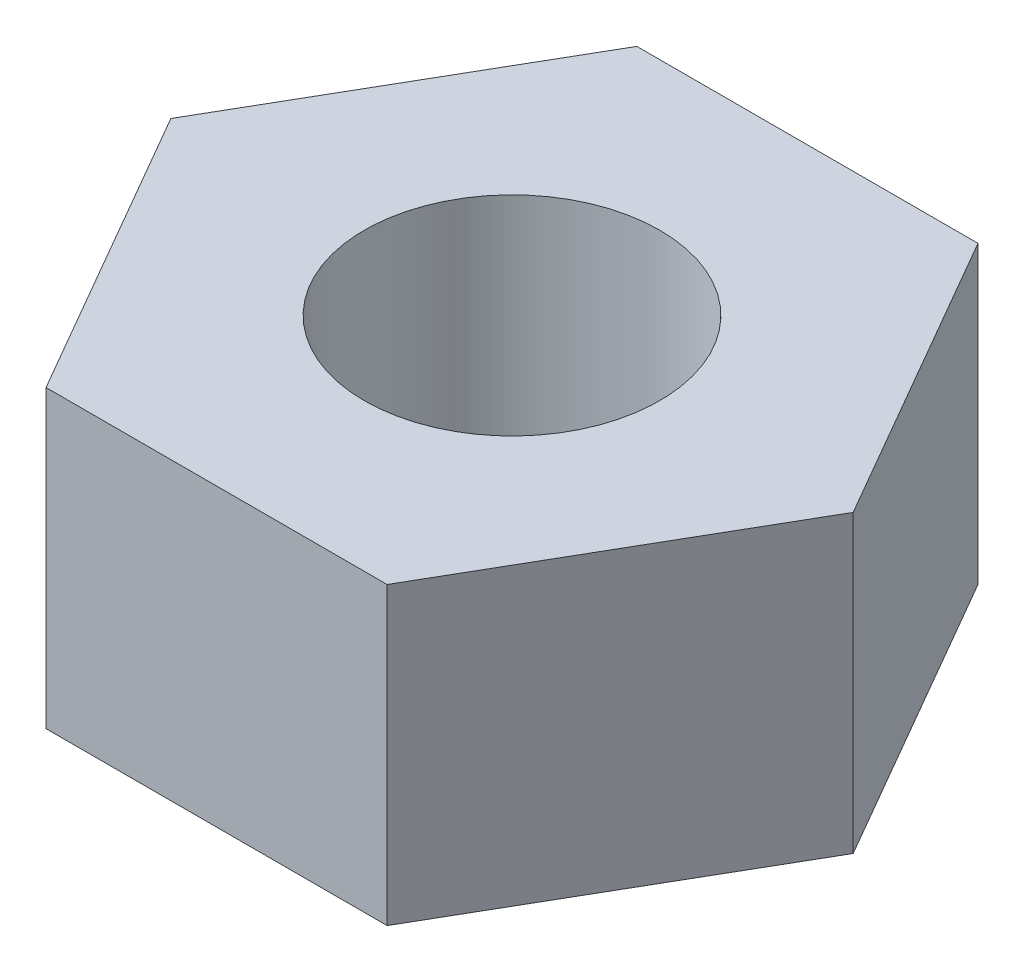
ISO-10303-21;
HEADER;
FILE_DESCRIPTION(('STEP AP214'),'2;1');
FILE_NAME('part.step','',(''),(''),'','','');
FILE_SCHEMA(('AUTOMOTIVE_DESIGN { 1 0 10303 214 1 1 1 1 }'));
ENDSEC;
DATA;
#1=APPLICATION_CONTEXT('core data for automotive mechanical design processes');
#2=APPLICATION_PROTOCOL_DEFINITION('international standard','automotive_design',2000,#1);
#3=PRODUCT_CONTEXT('',#1,'mechanical');
#4=PRODUCT('Part','Part','',(#3));
#5=PRODUCT_RELATED_PRODUCT_CATEGORY('part','',(#4));
#6=PRODUCT_DEFINITION_FORMATION('','',#4);
#7=PRODUCT_DEFINITION_CONTEXT('part definition',#1,'design');
#8=PRODUCT_DEFINITION('design','',#6,#7);
#9=PRODUCT_DEFINITION_SHAPE('','',#8);
#10=(LENGTH_UNIT() NAMED_UNIT(*) SI_UNIT(.MILLI.,.METRE.));
#11=(NAMED_UNIT(*) PLANE_ANGLE_UNIT() SI_UNIT($,.RADIAN.));
#12=(NAMED_UNIT(*) SI_UNIT($,.STERADIAN.) SOLID_ANGLE_UNIT());
#13=UNCERTAINTY_MEASURE_WITH_UNIT(LENGTH_MEASURE(1.E-05),#10,'distance_accuracy_value','');
#14=(GEOMETRIC_REPRESENTATION_CONTEXT(3) GLOBAL_UNCERTAINTY_ASSIGNED_CONTEXT((#13)) GLOBAL_UNIT_ASSIGNED_CONTEXT((#10,
#11,#12)) REPRESENTATION_CONTEXT('',''));
#15=CARTESIAN_POINT('',(0.,0.,0.));
#16=DIRECTION('',(0.,0.,1.));
#17=DIRECTION('',(1.,0.,0.));
#18=AXIS2_PLACEMENT_3D('',#15,#16,#17);
#19=CARTESIAN_POINT('',(0.,10.,0.));
#20=DIRECTION('',(0.,1.,0.));
#21=DIRECTION('',(0.,0.,1.));
#22=AXIS2_PLACEMENT_3D('',#19,#20,#21);
#23=PLANE('',#22);
#24=DIRECTION('',(0.499999999999995,0.,-0.866025403784442));
#25=VECTOR('',#24,1.);
#26=CARTESIAN_POINT('',(5.77350269189638,10.,9.99999999999994));
#27=LINE('',#26,#25);
#28=CARTESIAN_POINT('',(5.77350269189638,10.,9.99999999999994));
#29=VERTEX_POINT('',#28);
#30=CARTESIAN_POINT('',(11.5470053837925,10.,0.));
#31=VERTEX_POINT('',#30);
#32=EDGE_CURVE('E150',#29,#31,#27,.T.);
#33=ORIENTED_EDGE('',*,*,#32,.T.);
#34=DIRECTION('',(-0.500000000000001,0.,-0.866025403784438));
#35=VECTOR('',#34,1.);
#36=CARTESIAN_POINT('',(11.5470053837925,10.,0.));
#37=LINE('',#36,#35);
#38=CARTESIAN_POINT('',(5.77350269189624,10.,-10.));
#39=VERTEX_POINT('',#38);
#40=EDGE_CURVE('E98',#31,#39,#37,.T.);
#41=ORIENTED_EDGE('',*,*,#40,.T.);
#42=DIRECTION('',(-1.,0.,0.));
#43=VECTOR('',#42,1.);
#44=CARTESIAN_POINT('',(5.77350269189624,10.,-10.));
#45=LINE('',#44,#43);
#46=CARTESIAN_POINT('',(-5.77350269189631,10.,-9.99999999999998));
#47=VERTEX_POINT('',#46);
#48=EDGE_CURVE('E111',#39,#47,#45,.T.);
#49=ORIENTED_EDGE('',*,*,#48,.T.);
#50=DIRECTION('',(-0.499999999999995,0.,0.866025403784441));
#51=VECTOR('',#50,1.);
#52=CARTESIAN_POINT('',(-5.77350269189631,10.,-9.99999999999998));
#53=LINE('',#52,#51);
#54=CARTESIAN_POINT('',(-11.5470053837925,10.,0.));
#55=VERTEX_POINT('',#54);
#56=EDGE_CURVE('E105',#47,#55,#53,.T.);
#57=ORIENTED_EDGE('',*,*,#56,.T.);
#58=DIRECTION('',(0.500000000000007,0.,0.866025403784435));
#59=VECTOR('',#58,1.);
#60=CARTESIAN_POINT('',(-11.5470053837925,10.,0.));
#61=LINE('',#60,#59);
#62=CARTESIAN_POINT('',(-5.77350269189617,10.,10.0000000000001));
#63=VERTEX_POINT('',#62);
#64=EDGE_CURVE('E109',#55,#63,#61,.T.);
#65=ORIENTED_EDGE('',*,*,#64,.T.);
#66=DIRECTION('',(1.,0.,0.));
#67=VECTOR('',#66,1.);
#68=CARTESIAN_POINT('',(-5.77350269189617,10.,10.0000000000001));
#69=LINE('',#68,#67);
#70=EDGE_CURVE('E61',#63,#29,#69,.T.);
#71=ORIENTED_EDGE('',*,*,#70,.T.);
#72=EDGE_LOOP('',(#33,#41,#49,#57,#65,#71));
#73=FACE_BOUND('',#72,.T.);
#74=CARTESIAN_POINT('',(0.,10.,0.));
#75=DIRECTION('',(0.,1.,0.));
#76=DIRECTION('',(0.,0.,1.));
#77=AXIS2_PLACEMENT_3D('',#74,#75,#76);
#78=CIRCLE('',#77,5.);
#79=CARTESIAN_POINT('',(0.,10.,5.));
#80=VERTEX_POINT('',#79);
#81=EDGE_CURVE('E138',#80,#80,#78,.T.);
#82=ORIENTED_EDGE('',*,*,#81,.F.);
#83=EDGE_LOOP('',(#82));
#84=FACE_BOUND('',#83,.T.);
#85=ADVANCED_FACE('F43',(#73,#84),#23,.T.);
#86=CARTESIAN_POINT('',(0.,0.,0.));
#87=DIRECTION('',(0.,1.,0.));
#88=DIRECTION('',(0.,0.,1.));
#89=AXIS2_PLACEMENT_3D('',#86,#87,#88);
#90=PLANE('',#89);
#91=DIRECTION('',(0.499999999999995,0.,-0.866025403784442));
#92=VECTOR('',#91,1.);
#93=CARTESIAN_POINT('',(5.77350269189638,0.,9.99999999999994));
#94=LINE('',#93,#92);
#95=CARTESIAN_POINT('',(5.77350269189638,0.,9.99999999999994));
#96=VERTEX_POINT('',#95);
#97=CARTESIAN_POINT('',(11.5470053837925,0.,0.));
#98=VERTEX_POINT('',#97);
#99=EDGE_CURVE('E133',#96,#98,#94,.T.);
#100=ORIENTED_EDGE('',*,*,#99,.F.);
#101=DIRECTION('',(1.,0.,0.));
#102=VECTOR('',#101,1.);
#103=CARTESIAN_POINT('',(-5.77350269189617,0.,10.0000000000001));
#104=LINE('',#103,#102);
#105=CARTESIAN_POINT('',(-5.77350269189617,0.,10.0000000000001));
#106=VERTEX_POINT('',#105);
#107=EDGE_CURVE('E90',#106,#96,#104,.T.);
#108=ORIENTED_EDGE('',*,*,#107,.F.);
#109=DIRECTION('',(0.500000000000007,0.,0.866025403784435));
#110=VECTOR('',#109,1.);
#111=CARTESIAN_POINT('',(-11.5470053837925,0.,0.));
#112=LINE('',#111,#110);
#113=CARTESIAN_POINT('',(-11.5470053837925,0.,0.));
#114=VERTEX_POINT('',#113);
#115=EDGE_CURVE('E84',#114,#106,#112,.T.);
#116=ORIENTED_EDGE('',*,*,#115,.F.);
#117=DIRECTION('',(-0.499999999999995,0.,0.866025403784441));
#118=VECTOR('',#117,1.);
#119=CARTESIAN_POINT('',(-5.77350269189631,0.,-9.99999999999998));
#120=LINE('',#119,#118);
#121=CARTESIAN_POINT('',(-5.77350269189631,0.,-9.99999999999998));
#122=VERTEX_POINT('',#121);
#123=EDGE_CURVE('E120',#122,#114,#120,.T.);
#124=ORIENTED_EDGE('',*,*,#123,.F.);
#125=DIRECTION('',(-1.,0.,0.));
#126=VECTOR('',#125,1.);
#127=CARTESIAN_POINT('',(5.77350269189624,0.,-10.));
#128=LINE('',#127,#126);
#129=CARTESIAN_POINT('',(5.77350269189624,0.,-10.));
#130=VERTEX_POINT('',#129);
#131=EDGE_CURVE('E141',#130,#122,#128,.T.);
#132=ORIENTED_EDGE('',*,*,#131,.F.);
#133=DIRECTION('',(-0.500000000000001,0.,-0.866025403784438));
#134=VECTOR('',#133,1.);
#135=CARTESIAN_POINT('',(11.5470053837925,0.,0.));
#136=LINE('',#135,#134);
#137=EDGE_CURVE('E137',#98,#130,#136,.T.);
#138=ORIENTED_EDGE('',*,*,#137,.F.);
#139=EDGE_LOOP('',(#100,#108,#116,#124,#132,#138));
#140=FACE_BOUND('',#139,.T.);
#141=CARTESIAN_POINT('',(0.,0.,0.));
#142=DIRECTION('',(0.,1.,0.));
#143=DIRECTION('',(0.,0.,1.));
#144=AXIS2_PLACEMENT_3D('',#141,#142,#143);
#145=CIRCLE('',#144,5.);
#146=CARTESIAN_POINT('',(0.,0.,5.));
#147=VERTEX_POINT('',#146);
#148=EDGE_CURVE('E265',#147,#147,#145,.T.);
#149=ORIENTED_EDGE('',*,*,#148,.T.);
#150=EDGE_LOOP('',(#149));
#151=FACE_BOUND('',#150,.T.);
#152=ADVANCED_FACE('F163',(#140,#151),#90,.F.);
#153=CARTESIAN_POINT('',(5.77350269189638,10.,9.99999999999994));
#154=DIRECTION('',(-0.866025403784442,0.,-0.499999999999995));
#155=DIRECTION('',(-0.499999999999995,0.,0.866025403784442));
#156=AXIS2_PLACEMENT_3D('',#153,#154,#155);
#157=PLANE('',#156);
#158=ORIENTED_EDGE('',*,*,#99,.T.);
#159=DIRECTION('',(0.,-1.,0.));
#160=VECTOR('',#159,1.);
#161=CARTESIAN_POINT('',(11.5470053837925,10.,0.));
#162=LINE('',#161,#160);
#163=EDGE_CURVE('E11',#31,#98,#162,.T.);
#164=ORIENTED_EDGE('',*,*,#163,.F.);
#165=ORIENTED_EDGE('',*,*,#32,.F.);
#166=DIRECTION('',(0.,-1.,0.));
#167=VECTOR('',#166,1.);
#168=CARTESIAN_POINT('',(5.77350269189638,10.,9.99999999999994));
#169=LINE('',#168,#167);
#170=EDGE_CURVE('E129',#29,#96,#169,.T.);
#171=ORIENTED_EDGE('',*,*,#170,.T.);
#172=EDGE_LOOP('',(#158,#164,#165,#171));
#173=FACE_BOUND('',#172,.T.);
#174=ADVANCED_FACE('F45',(#173),#157,.F.);
#175=CARTESIAN_POINT('',(11.5470053837925,10.,0.));
#176=DIRECTION('',(-0.866025403784438,0.,0.500000000000001));
#177=DIRECTION('',(0.500000000000001,0.,0.866025403784438));
#178=AXIS2_PLACEMENT_3D('',#175,#176,#177);
#179=PLANE('',#178);
#180=ORIENTED_EDGE('',*,*,#137,.T.);
#181=DIRECTION('',(0.,-1.,0.));
#182=VECTOR('',#181,1.);
#183=CARTESIAN_POINT('',(5.77350269189624,10.,-10.));
#184=LINE('',#183,#182);
#185=EDGE_CURVE('E53',#39,#130,#184,.T.);
#186=ORIENTED_EDGE('',*,*,#185,.F.);
#187=ORIENTED_EDGE('',*,*,#40,.F.);
#188=ORIENTED_EDGE('',*,*,#163,.T.);
#189=EDGE_LOOP('',(#180,#186,#187,#188));
#190=FACE_BOUND('',#189,.T.);
#191=ADVANCED_FACE('F188',(#190),#179,.F.);
#192=CARTESIAN_POINT('',(5.77350269189624,10.,-10.));
#193=DIRECTION('',(0.,0.,1.));
#194=DIRECTION('',(1.,0.,0.));
#195=AXIS2_PLACEMENT_3D('',#192,#193,#194);
#196=PLANE('',#195);
#197=ORIENTED_EDGE('',*,*,#131,.T.);
#198=DIRECTION('',(0.,-1.,0.));
#199=VECTOR('',#198,1.);
#200=CARTESIAN_POINT('',(-5.77350269189631,10.,-9.99999999999998));
#201=LINE('',#200,#199);
#202=EDGE_CURVE('E122',#47,#122,#201,.T.);
#203=ORIENTED_EDGE('',*,*,#202,.F.);
#204=ORIENTED_EDGE('',*,*,#48,.F.);
#205=ORIENTED_EDGE('',*,*,#185,.T.);
#206=EDGE_LOOP('',(#197,#203,#204,#205));
#207=FACE_BOUND('',#206,.T.);
#208=ADVANCED_FACE('F160',(#207),#196,.F.);
#209=CARTESIAN_POINT('',(-5.77350269189631,10.,-9.99999999999998));
#210=DIRECTION('',(0.866025403784442,0.,0.499999999999995));
#211=DIRECTION('',(0.499999999999995,0.,-0.866025403784442));
#212=AXIS2_PLACEMENT_3D('',#209,#210,#211);
#213=PLANE('',#212);
#214=ORIENTED_EDGE('',*,*,#123,.T.);
#215=DIRECTION('',(0.,-1.,0.));
#216=VECTOR('',#215,1.);
#217=CARTESIAN_POINT('',(-11.5470053837925,10.,0.));
#218=LINE('',#217,#216);
#219=EDGE_CURVE('E117',#55,#114,#218,.T.);
#220=ORIENTED_EDGE('',*,*,#219,.F.);
#221=ORIENTED_EDGE('',*,*,#56,.F.);
#222=ORIENTED_EDGE('',*,*,#202,.T.);
#223=EDGE_LOOP('',(#214,#220,#221,#222));
#224=FACE_BOUND('',#223,.T.);
#225=ADVANCED_FACE('F118',(#224),#213,.F.);
#226=CARTESIAN_POINT('',(-11.5470053837925,10.,0.));
#227=DIRECTION('',(0.866025403784435,0.,-0.500000000000007));
#228=DIRECTION('',(-0.500000000000007,0.,-0.866025403784435));
#229=AXIS2_PLACEMENT_3D('',#226,#227,#228);
#230=PLANE('',#229);
#231=ORIENTED_EDGE('',*,*,#115,.T.);
#232=DIRECTION('',(0.,-1.,0.));
#233=VECTOR('',#232,1.);
#234=CARTESIAN_POINT('',(-5.77350269189617,10.,10.0000000000001));
#235=LINE('',#234,#233);
#236=EDGE_CURVE('E123',#63,#106,#235,.T.);
#237=ORIENTED_EDGE('',*,*,#236,.F.);
#238=ORIENTED_EDGE('',*,*,#64,.F.);
#239=ORIENTED_EDGE('',*,*,#219,.T.);
#240=EDGE_LOOP('',(#231,#237,#238,#239));
#241=FACE_BOUND('',#240,.T.);
#242=ADVANCED_FACE('F125',(#241),#230,.F.);
#243=CARTESIAN_POINT('',(-5.77350269189617,10.,10.0000000000001));
#244=DIRECTION('',(0.,0.,-1.));
#245=DIRECTION('',(-1.,0.,0.));
#246=AXIS2_PLACEMENT_3D('',#243,#244,#245);
#247=PLANE('',#246);
#248=ORIENTED_EDGE('',*,*,#107,.T.);
#249=ORIENTED_EDGE('',*,*,#170,.F.);
#250=ORIENTED_EDGE('',*,*,#70,.F.);
#251=ORIENTED_EDGE('',*,*,#236,.T.);
#252=EDGE_LOOP('',(#248,#249,#250,#251));
#253=FACE_BOUND('',#252,.T.);
#254=ADVANCED_FACE('F168',(#253),#247,.F.);
#255=CARTESIAN_POINT('',(0.,10.,0.));
#256=DIRECTION('',(0.,-1.,0.));
#257=DIRECTION('',(0.,0.,-1.));
#258=AXIS2_PLACEMENT_3D('',#255,#256,#257);
#259=CYLINDRICAL_SURFACE('',#258,5.);
#260=ORIENTED_EDGE('',*,*,#81,.T.);
#261=EDGE_LOOP('',(#260));
#262=FACE_BOUND('',#261,.T.);
#263=ORIENTED_EDGE('',*,*,#148,.F.);
#264=EDGE_LOOP('',(#263));
#265=FACE_BOUND('',#264,.T.);
#266=ADVANCED_FACE('F170',(#262,#265),#259,.F.);
#267=CLOSED_SHELL('',(#85,#152,#174,#191,#208,#225,#242,#254,#266));
#268=MANIFOLD_SOLID_BREP('B2',#267);
#269=ADVANCED_BREP_SHAPE_REPRESENTATION('',(#18,#268),#14);
#270=SHAPE_DEFINITION_REPRESENTATION(#9,#269);
ENDSEC;
END-ISO-10303-21;
